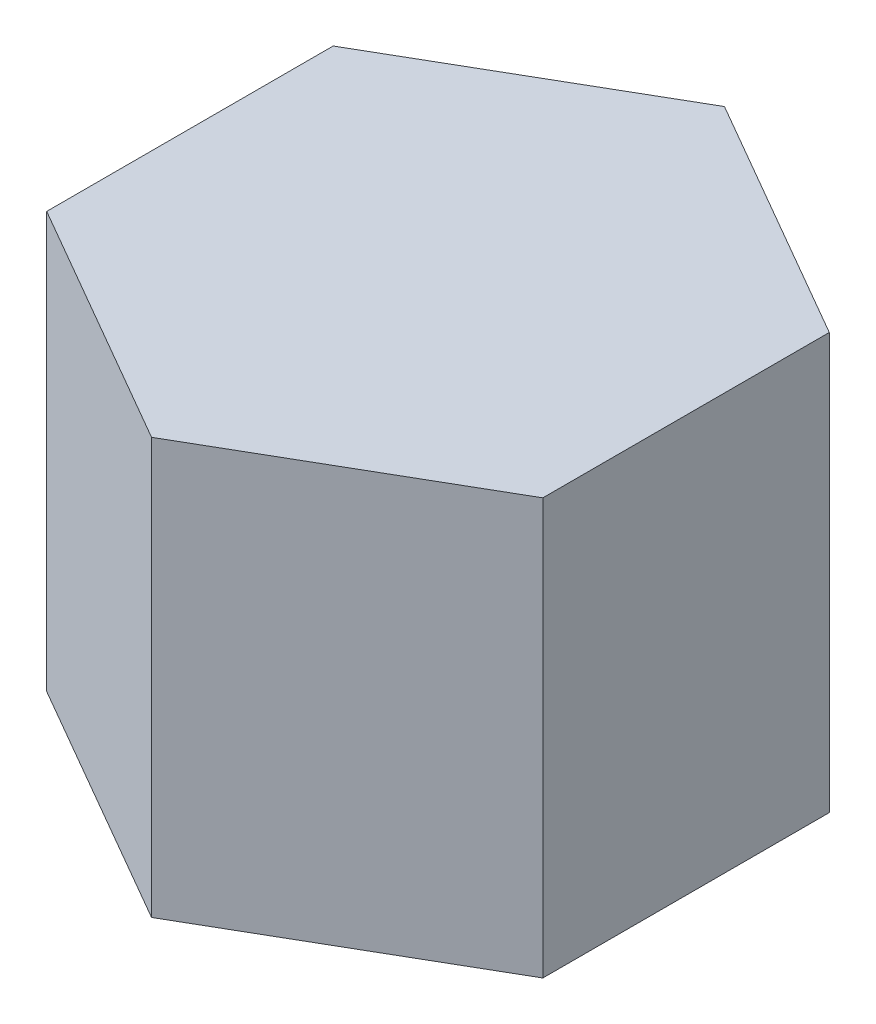
ISO-10303-21;
HEADER;
FILE_DESCRIPTION(('STEP AP214'),'2;1');
FILE_NAME('part.step','',(''),(''),'','','');
FILE_SCHEMA(('AUTOMOTIVE_DESIGN { 1 0 10303 214 1 1 1 1 }'));
ENDSEC;
DATA;
#1=APPLICATION_CONTEXT('core data for automotive mechanical design processes');
#2=APPLICATION_PROTOCOL_DEFINITION('international standard','automotive_design',2000,#1);
#3=PRODUCT_CONTEXT('',#1,'mechanical');
#4=PRODUCT('Part','Part','',(#3));
#5=PRODUCT_RELATED_PRODUCT_CATEGORY('part','',(#4));
#6=PRODUCT_DEFINITION_FORMATION('','',#4);
#7=PRODUCT_DEFINITION_CONTEXT('part definition',#1,'design');
#8=PRODUCT_DEFINITION('design','',#6,#7);
#9=PRODUCT_DEFINITION_SHAPE('','',#8);
#10=(LENGTH_UNIT() NAMED_UNIT(*) SI_UNIT(.MILLI.,.METRE.));
#11=(NAMED_UNIT(*) PLANE_ANGLE_UNIT() SI_UNIT($,.RADIAN.));
#12=(NAMED_UNIT(*) SI_UNIT($,.STERADIAN.) SOLID_ANGLE_UNIT());
#13=UNCERTAINTY_MEASURE_WITH_UNIT(LENGTH_MEASURE(1.E-05),#10,'distance_accuracy_value','');
#14=(GEOMETRIC_REPRESENTATION_CONTEXT(3) GLOBAL_UNCERTAINTY_ASSIGNED_CONTEXT((#13)) GLOBAL_UNIT_ASSIGNED_CONTEXT((#10,
#11,#12)) REPRESENTATION_CONTEXT('',''));
#15=CARTESIAN_POINT('',(0.,0.,0.));
#16=DIRECTION('',(0.,0.,1.));
#17=DIRECTION('',(1.,0.,0.));
#18=AXIS2_PLACEMENT_3D('',#15,#16,#17);
#19=CARTESIAN_POINT('',(205.642660308706,-148.537700895744,289.774920412926));
#20=DIRECTION('',(-0.499999999999943,0.,-0.866025403784472));
#21=DIRECTION('',(-0.866025403784472,0.,0.499999999999943));
#22=AXIS2_PLACEMENT_3D('',#19,#20,#21);
#23=PLANE('',#22);
#24=CARTESIAN_POINT('',(205.339551417382,-149.045793579175,289.949920412926));
#25=DIRECTION('',(0.866025403784471,0.,-0.499999999999943));
#26=VECTOR('',#25,1.);
#27=LINE('',#24,#26);
#28=CARTESIAN_POINT('',(205.339551417382,-149.045793579175,289.949920412926));
#29=VERTEX_POINT('',#28);
#30=CARTESIAN_POINT('',(205.642660308706,-149.045793579175,289.774920412926));
#31=VERTEX_POINT('',#30);
#32=EDGE_CURVE('E170',#29,#31,#27,.T.);
#33=ORIENTED_EDGE('',*,*,#32,.T.);
#34=CARTESIAN_POINT('',(205.642660308706,-148.537700895744,289.774920412926));
#35=DIRECTION('',(0.,-1.,0.));
#36=VECTOR('',#35,1.);
#37=LINE('',#34,#36);
#38=CARTESIAN_POINT('',(205.642660308706,-148.537700895744,289.774920412926));
#39=VERTEX_POINT('',#38);
#40=EDGE_CURVE('E35',#39,#31,#37,.T.);
#41=ORIENTED_EDGE('',*,*,#40,.F.);
#42=CARTESIAN_POINT('',(205.339551417382,-148.537700895744,289.949920412926));
#43=DIRECTION('',(0.866025403784471,0.,-0.499999999999943));
#44=VECTOR('',#43,1.);
#45=LINE('',#42,#44);
#46=CARTESIAN_POINT('',(205.339551417382,-148.537700895744,289.949920412926));
#47=VERTEX_POINT('',#46);
#48=EDGE_CURVE('E159',#47,#39,#45,.T.);
#49=ORIENTED_EDGE('',*,*,#48,.F.);
#50=CARTESIAN_POINT('',(205.339551417382,-148.537700895744,289.949920412926));
#51=DIRECTION('',(0.,-1.,0.));
#52=VECTOR('',#51,1.);
#53=LINE('',#50,#52);
#54=EDGE_CURVE('E10',#47,#29,#53,.T.);
#55=ORIENTED_EDGE('',*,*,#54,.T.);
#56=EDGE_LOOP('',(#33,#41,#49,#55));
#57=FACE_BOUND('',#56,.T.);
#58=ADVANCED_FACE('F16',(#57),#23,.F.);
#59=CARTESIAN_POINT('',(205.339551417382,-148.537700895744,289.949920412926));
#60=DIRECTION('',(0.500000000000062,0.,-0.866025403784403));
#61=DIRECTION('',(-0.866025403784403,0.,-0.500000000000062));
#62=AXIS2_PLACEMENT_3D('',#59,#60,#61);
#63=PLANE('',#62);
#64=CARTESIAN_POINT('',(205.036442526057,-149.045793579175,289.774920412925));
#65=DIRECTION('',(0.866025403784403,0.,0.500000000000062));
#66=VECTOR('',#65,1.);
#67=LINE('',#64,#66);
#68=CARTESIAN_POINT('',(205.036442526057,-149.045793579175,289.774920412925));
#69=VERTEX_POINT('',#68);
#70=EDGE_CURVE('E167',#69,#29,#67,.T.);
#71=ORIENTED_EDGE('',*,*,#70,.T.);
#72=ORIENTED_EDGE('',*,*,#54,.F.);
#73=CARTESIAN_POINT('',(205.036442526057,-148.537700895744,289.774920412925));
#74=DIRECTION('',(0.866025403784403,0.,0.500000000000062));
#75=VECTOR('',#74,1.);
#76=LINE('',#73,#75);
#77=CARTESIAN_POINT('',(205.036442526057,-148.537700895744,289.774920412925));
#78=VERTEX_POINT('',#77);
#79=EDGE_CURVE('E156',#78,#47,#76,.T.);
#80=ORIENTED_EDGE('',*,*,#79,.F.);
#81=CARTESIAN_POINT('',(205.036442526057,-148.537700895744,289.774920412925));
#82=DIRECTION('',(0.,-1.,0.));
#83=VECTOR('',#82,1.);
#84=LINE('',#81,#83);
#85=EDGE_CURVE('E27',#78,#69,#84,.T.);
#86=ORIENTED_EDGE('',*,*,#85,.T.);
#87=EDGE_LOOP('',(#71,#72,#80,#86));
#88=FACE_BOUND('',#87,.T.);
#89=ADVANCED_FACE('F189',(#88),#63,.F.);
#90=CARTESIAN_POINT('',(205.036442526057,-148.537700895744,290.831971220494));
#91=DIRECTION('',(1.,0.,0.));
#92=DIRECTION('',(0.,1.,0.));
#93=AXIS2_PLACEMENT_3D('',#90,#91,#92);
#94=PLANE('',#93);
#95=CARTESIAN_POINT('',(205.036442526057,-149.045793579175,289.424920412926));
#96=DIRECTION('',(0.,0.,1.));
#97=VECTOR('',#96,1.);
#98=LINE('',#95,#97);
#99=CARTESIAN_POINT('',(205.036442526057,-149.045793579175,289.424920412926));
#100=VERTEX_POINT('',#99);
#101=EDGE_CURVE('E163',#100,#69,#98,.T.);
#102=ORIENTED_EDGE('',*,*,#101,.T.);
#103=ORIENTED_EDGE('',*,*,#85,.F.);
#104=CARTESIAN_POINT('',(205.036442526057,-148.537700895744,289.424920412926));
#105=DIRECTION('',(0.,0.,1.));
#106=VECTOR('',#105,1.);
#107=LINE('',#104,#106);
#108=CARTESIAN_POINT('',(205.036442526057,-148.537700895744,289.424920412926));
#109=VERTEX_POINT('',#108);
#110=EDGE_CURVE('E106',#109,#78,#107,.T.);
#111=ORIENTED_EDGE('',*,*,#110,.F.);
#112=CARTESIAN_POINT('',(205.036442526057,-148.537700895744,289.424920412926));
#113=DIRECTION('',(0.,-1.,0.));
#114=VECTOR('',#113,1.);
#115=LINE('',#112,#114);
#116=EDGE_CURVE('E94',#109,#100,#115,.T.);
#117=ORIENTED_EDGE('',*,*,#116,.T.);
#118=EDGE_LOOP('',(#102,#103,#111,#117));
#119=FACE_BOUND('',#118,.T.);
#120=ADVANCED_FACE('F198',(#119),#94,.F.);
#121=CARTESIAN_POINT('',(205.036442526057,-148.537700895744,289.424920412926));
#122=DIRECTION('',(0.499999999999978,0.,0.866025403784452));
#123=DIRECTION('',(0.866025403784452,0.,-0.499999999999978));
#124=AXIS2_PLACEMENT_3D('',#121,#122,#123);
#125=PLANE('',#124);
#126=CARTESIAN_POINT('',(205.339551417382,-149.045793579175,289.249920412926));
#127=DIRECTION('',(-0.866025403784452,0.,0.499999999999978));
#128=VECTOR('',#127,1.);
#129=LINE('',#126,#128);
#130=CARTESIAN_POINT('',(205.339551417382,-149.045793579175,289.249920412926));
#131=VERTEX_POINT('',#130);
#132=EDGE_CURVE('E162',#131,#100,#129,.T.);
#133=ORIENTED_EDGE('',*,*,#132,.T.);
#134=ORIENTED_EDGE('',*,*,#116,.F.);
#135=CARTESIAN_POINT('',(205.339551417382,-148.537700895744,289.249920412926));
#136=DIRECTION('',(-0.866025403784452,0.,0.499999999999978));
#137=VECTOR('',#136,1.);
#138=LINE('',#135,#137);
#139=CARTESIAN_POINT('',(205.339551417382,-148.537700895744,289.249920412926));
#140=VERTEX_POINT('',#139);
#141=EDGE_CURVE('E98',#140,#109,#138,.T.);
#142=ORIENTED_EDGE('',*,*,#141,.F.);
#143=CARTESIAN_POINT('',(205.339551417382,-148.537700895744,289.249920412926));
#144=DIRECTION('',(0.,-1.,0.));
#145=VECTOR('',#144,1.);
#146=LINE('',#143,#145);
#147=EDGE_CURVE('E79',#140,#131,#146,.T.);
#148=ORIENTED_EDGE('',*,*,#147,.T.);
#149=EDGE_LOOP('',(#133,#134,#142,#148));
#150=FACE_BOUND('',#149,.T.);
#151=ADVANCED_FACE('F100',(#150),#125,.F.);
#152=CARTESIAN_POINT('',(205.339551417382,-148.537700895744,289.249920412926));
#153=DIRECTION('',(-0.499999999999943,0.,0.866025403784472));
#154=DIRECTION('',(0.866025403784472,0.,0.499999999999943));
#155=AXIS2_PLACEMENT_3D('',#152,#153,#154);
#156=PLANE('',#155);
#157=CARTESIAN_POINT('',(205.642660308706,-149.045793579175,289.424920412926));
#158=DIRECTION('',(-0.866025403784471,0.,-0.499999999999943));
#159=VECTOR('',#158,1.);
#160=LINE('',#157,#159);
#161=CARTESIAN_POINT('',(205.642660308706,-149.045793579175,289.424920412926));
#162=VERTEX_POINT('',#161);
#163=EDGE_CURVE('E88',#162,#131,#160,.T.);
#164=ORIENTED_EDGE('',*,*,#163,.T.);
#165=ORIENTED_EDGE('',*,*,#147,.F.);
#166=CARTESIAN_POINT('',(205.642660308706,-148.537700895744,289.424920412926));
#167=DIRECTION('',(-0.866025403784471,0.,-0.499999999999943));
#168=VECTOR('',#167,1.);
#169=LINE('',#166,#168);
#170=CARTESIAN_POINT('',(205.642660308706,-148.537700895744,289.424920412926));
#171=VERTEX_POINT('',#170);
#172=EDGE_CURVE('E84',#171,#140,#169,.T.);
#173=ORIENTED_EDGE('',*,*,#172,.F.);
#174=CARTESIAN_POINT('',(205.642660308706,-148.537700895744,289.424920412926));
#175=DIRECTION('',(0.,-1.,0.));
#176=VECTOR('',#175,1.);
#177=LINE('',#174,#176);
#178=EDGE_CURVE('E58',#171,#162,#177,.T.);
#179=ORIENTED_EDGE('',*,*,#178,.T.);
#180=EDGE_LOOP('',(#164,#165,#173,#179));
#181=FACE_BOUND('',#180,.T.);
#182=ADVANCED_FACE('F82',(#181),#156,.F.);
#183=CARTESIAN_POINT('',(205.642660308706,-148.537700895744,290.831971220494));
#184=DIRECTION('',(-1.,0.,0.));
#185=DIRECTION('',(0.,-1.,0.));
#186=AXIS2_PLACEMENT_3D('',#183,#184,#185);
#187=PLANE('',#186);
#188=CARTESIAN_POINT('',(205.642660308706,-149.045793579175,289.774920412926));
#189=DIRECTION('',(0.,0.,-1.));
#190=VECTOR('',#189,1.);
#191=LINE('',#188,#190);
#192=EDGE_CURVE('E160',#31,#162,#191,.T.);
#193=ORIENTED_EDGE('',*,*,#192,.T.);
#194=ORIENTED_EDGE('',*,*,#178,.F.);
#195=CARTESIAN_POINT('',(205.642660308706,-148.537700895744,289.774920412926));
#196=DIRECTION('',(0.,0.,-1.));
#197=VECTOR('',#196,1.);
#198=LINE('',#195,#197);
#199=EDGE_CURVE('E112',#39,#171,#198,.T.);
#200=ORIENTED_EDGE('',*,*,#199,.F.);
#201=ORIENTED_EDGE('',*,*,#40,.T.);
#202=EDGE_LOOP('',(#193,#194,#200,#201));
#203=FACE_BOUND('',#202,.T.);
#204=ADVANCED_FACE('F131',(#203),#187,.F.);
#205=CARTESIAN_POINT('',(206.339551417382,-148.537700895744,290.831971220494));
#206=DIRECTION('',(0.,-1.,0.));
#207=DIRECTION('',(1.,0.,0.));
#208=AXIS2_PLACEMENT_3D('',#205,#206,#207);
#209=PLANE('',#208);
#210=ORIENTED_EDGE('',*,*,#48,.T.);
#211=ORIENTED_EDGE('',*,*,#199,.T.);
#212=ORIENTED_EDGE('',*,*,#172,.T.);
#213=ORIENTED_EDGE('',*,*,#141,.T.);
#214=ORIENTED_EDGE('',*,*,#110,.T.);
#215=ORIENTED_EDGE('',*,*,#79,.T.);
#216=EDGE_LOOP('',(#210,#211,#212,#213,#214,#215));
#217=FACE_BOUND('',#216,.T.);
#218=ADVANCED_FACE('F111',(#217),#209,.F.);
#219=CARTESIAN_POINT('',(206.339551417382,-149.045793579175,290.831971220494));
#220=DIRECTION('',(0.,-1.,0.));
#221=DIRECTION('',(1.,0.,0.));
#222=AXIS2_PLACEMENT_3D('',#219,#220,#221);
#223=PLANE('',#222);
#224=ORIENTED_EDGE('',*,*,#32,.F.);
#225=ORIENTED_EDGE('',*,*,#70,.F.);
#226=ORIENTED_EDGE('',*,*,#101,.F.);
#227=ORIENTED_EDGE('',*,*,#132,.F.);
#228=ORIENTED_EDGE('',*,*,#163,.F.);
#229=ORIENTED_EDGE('',*,*,#192,.F.);
#230=EDGE_LOOP('',(#224,#225,#226,#227,#228,#229));
#231=FACE_BOUND('',#230,.T.);
#232=ADVANCED_FACE('F130',(#231),#223,.T.);
#233=CLOSED_SHELL('',(#58,#89,#120,#151,#182,#204,#218,#232));
#234=MANIFOLD_SOLID_BREP('B1',#233);
#235=ADVANCED_BREP_SHAPE_REPRESENTATION('',(#18,#234),#14);
#236=SHAPE_DEFINITION_REPRESENTATION(#9,#235);
ENDSEC;
END-ISO-10303-21;
